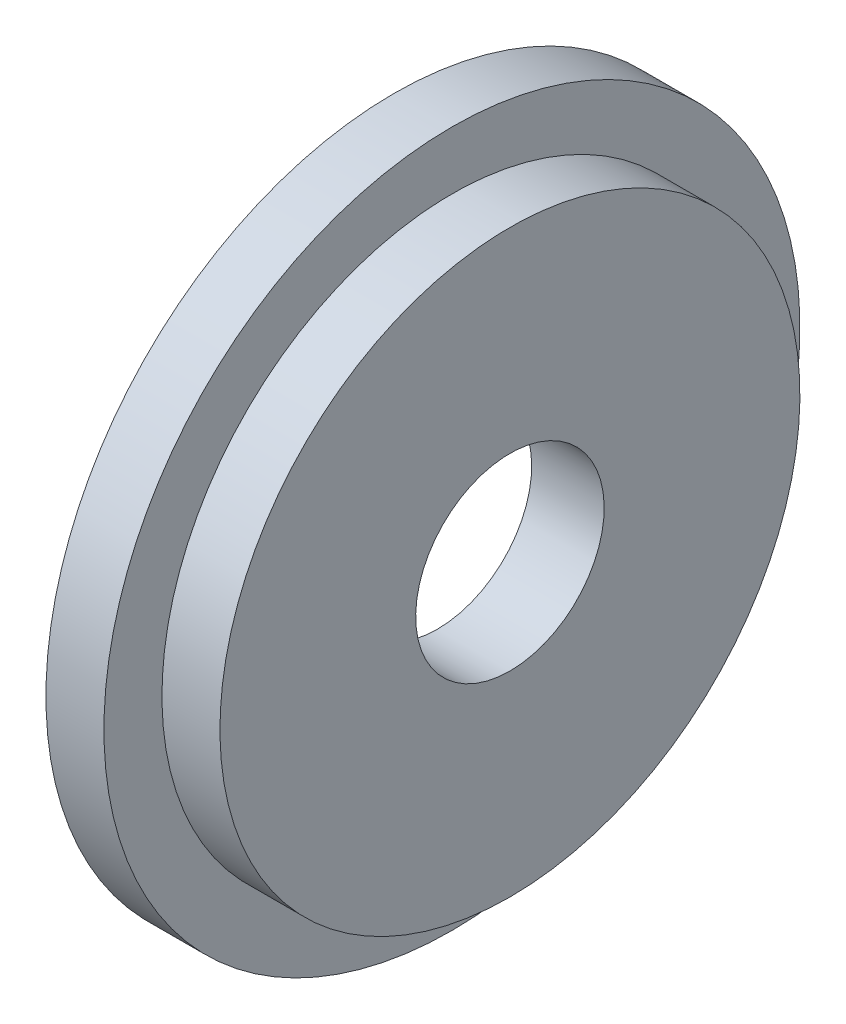
ISO-10303-21;
HEADER;
FILE_DESCRIPTION(('STEP AP214'),'2;1');
FILE_NAME('part.step','',(''),(''),'','','');
FILE_SCHEMA(('AUTOMOTIVE_DESIGN { 1 0 10303 214 1 1 1 1 }'));
ENDSEC;
DATA;
#1=APPLICATION_CONTEXT('core data for automotive mechanical design processes');
#2=APPLICATION_PROTOCOL_DEFINITION('international standard','automotive_design',2000,#1);
#3=PRODUCT_CONTEXT('',#1,'mechanical');
#4=PRODUCT('Part','Part','',(#3));
#5=PRODUCT_RELATED_PRODUCT_CATEGORY('part','',(#4));
#6=PRODUCT_DEFINITION_FORMATION('','',#4);
#7=PRODUCT_DEFINITION_CONTEXT('part definition',#1,'design');
#8=PRODUCT_DEFINITION('design','',#6,#7);
#9=PRODUCT_DEFINITION_SHAPE('','',#8);
#10=(LENGTH_UNIT() NAMED_UNIT(*) SI_UNIT(.MILLI.,.METRE.));
#11=(NAMED_UNIT(*) PLANE_ANGLE_UNIT() SI_UNIT($,.RADIAN.));
#12=(NAMED_UNIT(*) SI_UNIT($,.STERADIAN.) SOLID_ANGLE_UNIT());
#13=UNCERTAINTY_MEASURE_WITH_UNIT(LENGTH_MEASURE(1.E-05),#10,'distance_accuracy_value','');
#14=(GEOMETRIC_REPRESENTATION_CONTEXT(3) GLOBAL_UNCERTAINTY_ASSIGNED_CONTEXT((#13)) GLOBAL_UNIT_ASSIGNED_CONTEXT((#10,
#11,#12)) REPRESENTATION_CONTEXT('',''));
#15=CARTESIAN_POINT('',(0.,0.,0.));
#16=DIRECTION('',(0.,0.,1.));
#17=DIRECTION('',(1.,0.,0.));
#18=AXIS2_PLACEMENT_3D('',#15,#16,#17);
#19=CARTESIAN_POINT('',(-4.48019609728162,0.,0.));
#20=DIRECTION('',(-1.,0.,0.));
#21=DIRECTION('',(0.,-1.,0.));
#22=AXIS2_PLACEMENT_3D('',#19,#20,#21);
#23=CYLINDRICAL_SURFACE('',#22,12.);
#24=CARTESIAN_POINT('',(-4.48019609728162,0.,0.));
#25=DIRECTION('',(-1.,0.,0.));
#26=DIRECTION('',(0.,-1.,0.));
#27=AXIS2_PLACEMENT_3D('',#24,#25,#26);
#28=CIRCLE('',#27,12.);
#29=CARTESIAN_POINT('',(-4.48019609728162,-12.,0.));
#30=VERTEX_POINT('',#29);
#31=EDGE_CURVE('E62',#30,#30,#28,.T.);
#32=ORIENTED_EDGE('',*,*,#31,.F.);
#33=EDGE_LOOP('',(#32));
#34=FACE_BOUND('',#33,.T.);
#35=CARTESIAN_POINT('',(-2.48019609728162,0.,0.));
#36=DIRECTION('',(-1.,0.,0.));
#37=DIRECTION('',(0.,-1.,0.));
#38=AXIS2_PLACEMENT_3D('',#35,#36,#37);
#39=CIRCLE('',#38,12.);
#40=CARTESIAN_POINT('',(-2.48019609728161,-12.,0.));
#41=VERTEX_POINT('',#40);
#42=EDGE_CURVE('E10',#41,#41,#39,.T.);
#43=ORIENTED_EDGE('',*,*,#42,.T.);
#44=EDGE_LOOP('',(#43));
#45=FACE_BOUND('',#44,.T.);
#46=ADVANCED_FACE('F34',(#34,#45),#23,.T.);
#47=CARTESIAN_POINT('',(-2.48019609728162,12.,0.));
#48=DIRECTION('',(-1.,0.,0.));
#49=DIRECTION('',(0.,-1.,0.));
#50=AXIS2_PLACEMENT_3D('',#47,#48,#49);
#51=PLANE('',#50);
#52=ORIENTED_EDGE('',*,*,#42,.F.);
#53=EDGE_LOOP('',(#52));
#54=FACE_BOUND('',#53,.T.);
#55=CARTESIAN_POINT('',(-2.48019609728162,0.,0.));
#56=DIRECTION('',(-1.,0.,0.));
#57=DIRECTION('',(0.,-1.,0.));
#58=AXIS2_PLACEMENT_3D('',#55,#56,#57);
#59=CIRCLE('',#58,10.);
#60=CARTESIAN_POINT('',(-2.48019609728161,-10.,0.));
#61=VERTEX_POINT('',#60);
#62=EDGE_CURVE('E40',#61,#61,#59,.T.);
#63=ORIENTED_EDGE('',*,*,#62,.T.);
#64=EDGE_LOOP('',(#63));
#65=FACE_BOUND('',#64,.T.);
#66=ADVANCED_FACE('F69',(#54,#65),#51,.F.);
#67=CARTESIAN_POINT('',(-4.48019609728162,0.,0.));
#68=DIRECTION('',(-1.,0.,0.));
#69=DIRECTION('',(0.,-1.,0.));
#70=AXIS2_PLACEMENT_3D('',#67,#68,#69);
#71=CYLINDRICAL_SURFACE('',#70,10.);
#72=ORIENTED_EDGE('',*,*,#62,.F.);
#73=EDGE_LOOP('',(#72));
#74=FACE_BOUND('',#73,.T.);
#75=CARTESIAN_POINT('',(-0.480196097281615,0.,0.));
#76=DIRECTION('',(-1.,0.,0.));
#77=DIRECTION('',(0.,-1.,0.));
#78=AXIS2_PLACEMENT_3D('',#75,#76,#77);
#79=CIRCLE('',#78,10.);
#80=CARTESIAN_POINT('',(-0.480196097281613,-10.,0.));
#81=VERTEX_POINT('',#80);
#82=EDGE_CURVE('E44',#81,#81,#79,.T.);
#83=ORIENTED_EDGE('',*,*,#82,.T.);
#84=EDGE_LOOP('',(#83));
#85=FACE_BOUND('',#84,.T.);
#86=ADVANCED_FACE('F73',(#74,#85),#71,.T.);
#87=CARTESIAN_POINT('',(-0.480196097281616,10.,0.));
#88=DIRECTION('',(-1.,0.,0.));
#89=DIRECTION('',(0.,-1.,0.));
#90=AXIS2_PLACEMENT_3D('',#87,#88,#89);
#91=PLANE('',#90);
#92=ORIENTED_EDGE('',*,*,#82,.F.);
#93=EDGE_LOOP('',(#92));
#94=FACE_BOUND('',#93,.T.);
#95=CARTESIAN_POINT('',(-0.480196097281615,0.,0.));
#96=DIRECTION('',(-1.,0.,0.));
#97=DIRECTION('',(0.,-1.,0.));
#98=AXIS2_PLACEMENT_3D('',#95,#96,#97);
#99=CIRCLE('',#98,3.25);
#100=CARTESIAN_POINT('',(-0.480196097281615,-3.25000000000001,0.));
#101=VERTEX_POINT('',#100);
#102=EDGE_CURVE('E48',#101,#101,#99,.T.);
#103=ORIENTED_EDGE('',*,*,#102,.T.);
#104=EDGE_LOOP('',(#103));
#105=FACE_BOUND('',#104,.T.);
#106=ADVANCED_FACE('F78',(#94,#105),#91,.F.);
#107=CARTESIAN_POINT('',(-4.48019609728162,0.,0.));
#108=DIRECTION('',(-1.,0.,0.));
#109=DIRECTION('',(0.,-1.,0.));
#110=AXIS2_PLACEMENT_3D('',#107,#108,#109);
#111=CYLINDRICAL_SURFACE('',#110,3.25);
#112=ORIENTED_EDGE('',*,*,#102,.F.);
#113=EDGE_LOOP('',(#112));
#114=FACE_BOUND('',#113,.T.);
#115=CARTESIAN_POINT('',(-2.98019609728162,0.,0.));
#116=DIRECTION('',(-1.,0.,0.));
#117=DIRECTION('',(0.,-1.,0.));
#118=AXIS2_PLACEMENT_3D('',#115,#116,#117);
#119=CIRCLE('',#118,3.25);
#120=CARTESIAN_POINT('',(-2.98019609728162,-3.25000000000001,0.));
#121=VERTEX_POINT('',#120);
#122=EDGE_CURVE('E53',#121,#121,#119,.T.);
#123=ORIENTED_EDGE('',*,*,#122,.T.);
#124=EDGE_LOOP('',(#123));
#125=FACE_BOUND('',#124,.T.);
#126=ADVANCED_FACE('F84',(#114,#125),#111,.F.);
#127=CARTESIAN_POINT('',(-2.98019609728162,8.5,0.));
#128=DIRECTION('',(1.,0.,0.));
#129=DIRECTION('',(0.,1.,0.));
#130=AXIS2_PLACEMENT_3D('',#127,#128,#129);
#131=PLANE('',#130);
#132=ORIENTED_EDGE('',*,*,#122,.F.);
#133=EDGE_LOOP('',(#132));
#134=FACE_BOUND('',#133,.T.);
#135=CARTESIAN_POINT('',(-2.98019609728162,0.,0.));
#136=DIRECTION('',(-1.,0.,0.));
#137=DIRECTION('',(0.,-1.,0.));
#138=AXIS2_PLACEMENT_3D('',#135,#136,#137);
#139=CIRCLE('',#138,8.50000000000001);
#140=CARTESIAN_POINT('',(-2.98019609728162,-8.50000000000002,0.));
#141=VERTEX_POINT('',#140);
#142=EDGE_CURVE('E56',#141,#141,#139,.T.);
#143=ORIENTED_EDGE('',*,*,#142,.T.);
#144=EDGE_LOOP('',(#143));
#145=FACE_BOUND('',#144,.T.);
#146=ADVANCED_FACE('F88',(#134,#145),#131,.F.);
#147=CARTESIAN_POINT('',(-4.48019609728162,0.,0.));
#148=DIRECTION('',(-1.,0.,0.));
#149=DIRECTION('',(0.,-1.,0.));
#150=AXIS2_PLACEMENT_3D('',#147,#148,#149);
#151=CYLINDRICAL_SURFACE('',#150,8.50000000000001);
#152=ORIENTED_EDGE('',*,*,#142,.F.);
#153=EDGE_LOOP('',(#152));
#154=FACE_BOUND('',#153,.T.);
#155=CARTESIAN_POINT('',(-4.48019609728162,0.,0.));
#156=DIRECTION('',(-1.,0.,0.));
#157=DIRECTION('',(0.,-1.,0.));
#158=AXIS2_PLACEMENT_3D('',#155,#156,#157);
#159=CIRCLE('',#158,8.50000000000001);
#160=CARTESIAN_POINT('',(-4.48019609728162,-8.50000000000002,0.));
#161=VERTEX_POINT('',#160);
#162=EDGE_CURVE('E59',#161,#161,#159,.T.);
#163=ORIENTED_EDGE('',*,*,#162,.T.);
#164=EDGE_LOOP('',(#163));
#165=FACE_BOUND('',#164,.T.);
#166=ADVANCED_FACE('F92',(#154,#165),#151,.F.);
#167=CARTESIAN_POINT('',(-4.48019609728162,8.5,0.));
#168=DIRECTION('',(1.,0.,0.));
#169=DIRECTION('',(0.,1.,0.));
#170=AXIS2_PLACEMENT_3D('',#167,#168,#169);
#171=PLANE('',#170);
#172=ORIENTED_EDGE('',*,*,#162,.F.);
#173=EDGE_LOOP('',(#172));
#174=FACE_BOUND('',#173,.T.);
#175=ORIENTED_EDGE('',*,*,#31,.T.);
#176=EDGE_LOOP('',(#175));
#177=FACE_BOUND('',#176,.T.);
#178=ADVANCED_FACE('F66',(#174,#177),#171,.F.);
#179=CLOSED_SHELL('',(#46,#66,#86,#106,#126,#146,#166,#178));
#180=MANIFOLD_SOLID_BREP('B2',#179);
#181=ADVANCED_BREP_SHAPE_REPRESENTATION('',(#18,#180),#14);
#182=SHAPE_DEFINITION_REPRESENTATION(#9,#181);
ENDSEC;
END-ISO-10303-21;
